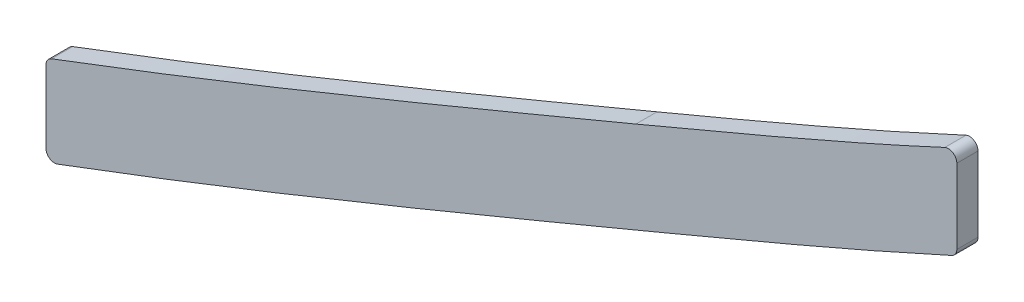
ISO-10303-21;
HEADER;
FILE_DESCRIPTION(('STEP AP214'),'2;1');
FILE_NAME('part.step','',(''),(''),'','','');
FILE_SCHEMA(('AUTOMOTIVE_DESIGN { 1 0 10303 214 1 1 1 1 }'));
ENDSEC;
DATA;
#1=APPLICATION_CONTEXT('core data for automotive mechanical design processes');
#2=APPLICATION_PROTOCOL_DEFINITION('international standard','automotive_design',2000,#1);
#3=PRODUCT_CONTEXT('',#1,'mechanical');
#4=PRODUCT('Part','Part','',(#3));
#5=PRODUCT_RELATED_PRODUCT_CATEGORY('part','',(#4));
#6=PRODUCT_DEFINITION_FORMATION('','',#4);
#7=PRODUCT_DEFINITION_CONTEXT('part definition',#1,'design');
#8=PRODUCT_DEFINITION('design','',#6,#7);
#9=PRODUCT_DEFINITION_SHAPE('','',#8);
#10=(LENGTH_UNIT() NAMED_UNIT(*) SI_UNIT(.MILLI.,.METRE.));
#11=(NAMED_UNIT(*) PLANE_ANGLE_UNIT() SI_UNIT($,.RADIAN.));
#12=(NAMED_UNIT(*) SI_UNIT($,.STERADIAN.) SOLID_ANGLE_UNIT());
#13=UNCERTAINTY_MEASURE_WITH_UNIT(LENGTH_MEASURE(1.E-05),#10,'distance_accuracy_value','');
#14=(GEOMETRIC_REPRESENTATION_CONTEXT(3) GLOBAL_UNCERTAINTY_ASSIGNED_CONTEXT((#13)) GLOBAL_UNIT_ASSIGNED_CONTEXT((#10,
#11,#12)) REPRESENTATION_CONTEXT('',''));
#15=CARTESIAN_POINT('',(0.,0.,0.));
#16=DIRECTION('',(0.,0.,1.));
#17=DIRECTION('',(1.,0.,0.));
#18=AXIS2_PLACEMENT_3D('',#15,#16,#17);
#19=CARTESIAN_POINT('',(191.607801579572,152.412778164943,-1.5875));
#20=CARTESIAN_POINT('',(201.073409420005,156.36620357869,-1.5875));
#21=CARTESIAN_POINT('',(210.56673521577,160.366210113804,-1.5875));
#22=CARTESIAN_POINT('',(220.096436884332,164.442364028046,-1.5875));
#23=CARTESIAN_POINT('',(229.661309685847,168.660462927977,-1.5875));
#24=CARTESIAN_POINT('',(239.230812588027,173.146496258096,-1.5875));
#25=(BOUNDED_CURVE() B_SPLINE_CURVE(5,(#19,#20,#21,#22,#23,#24),.UNSPECIFIED.,.F.,
.F.) B_SPLINE_CURVE_WITH_KNOTS((6,6),(14.8178103643843,19.6836854575926),
.UNSPECIFIED.) CURVE() GEOMETRIC_REPRESENTATION_ITEM() RATIONAL_B_SPLINE_CURVE((1.,1.,1.,1.,1.,1.)) REPRESENTATION_ITEM(''));
#26=DIRECTION('',(0.,0.,1.));
#27=VECTOR('',#26,1.);
#28=SURFACE_OF_LINEAR_EXTRUSION('',#25,#27);
#29=CARTESIAN_POINT('',(191.607801579572,152.412778164943,1.5875));
#30=CARTESIAN_POINT('',(200.811370336155,156.256759791144,1.5875));
#31=CARTESIAN_POINT('',(210.04114364221,160.144779200243,1.5875));
#32=CARTESIAN_POINT('',(219.305080098179,164.104014525206,1.5875));
#33=CARTESIAN_POINT('',(228.60232325091,168.194026782366,1.5875));
#34=CARTESIAN_POINT('',(237.906278264735,172.527582446985,1.5875));
#35=(BOUNDED_CURVE() B_SPLINE_CURVE(5,(#29,#30,#31,#32,#33,#34),.UNSPECIFIED.,.F.,
.F.) B_SPLINE_CURVE_WITH_KNOTS((6,6),(14.8178103643843,19.5489820689624),
.UNSPECIFIED.) CURVE() GEOMETRIC_REPRESENTATION_ITEM() RATIONAL_B_SPLINE_CURVE((1.,1.,1.,1.,1.,1.)) REPRESENTATION_ITEM(''));
#36=CARTESIAN_POINT('',(191.607801579572,152.412778164943,1.5875));
#37=VERTEX_POINT('',#36);
#38=CARTESIAN_POINT('',(237.906188472619,172.527775503803,1.5875));
#39=VERTEX_POINT('',#38);
#40=EDGE_CURVE('E228',#37,#39,#35,.T.);
#41=ORIENTED_EDGE('',*,*,#40,.T.);
#42=DIRECTION('',(0.,0.,1.));
#43=VECTOR('',#42,1.);
#44=CARTESIAN_POINT('',(237.906277943178,172.527582297211,1.5875));
#45=LINE('',#44,#43);
#46=CARTESIAN_POINT('',(237.906188323409,172.52777543439,-1.5875));
#47=VERTEX_POINT('',#46);
#48=EDGE_CURVE('E139',#39,#47,#45,.F.);
#49=ORIENTED_EDGE('',*,*,#48,.T.);
#50=CARTESIAN_POINT('',(237.9062782216,172.527582426893,-1.5875));
#51=CARTESIAN_POINT('',(228.602323216427,168.194026767197,-1.5875));
#52=CARTESIAN_POINT('',(219.305080072409,164.104014514193,-1.5875));
#53=CARTESIAN_POINT('',(210.041143625094,160.144779193032,-1.5875));
#54=CARTESIAN_POINT('',(200.811370327621,156.25675978758,-1.5875));
#55=CARTESIAN_POINT('',(191.607801579572,152.412778164943,-1.5875));
#56=(BOUNDED_CURVE() B_SPLINE_CURVE(5,(#50,#51,#52,#53,#54,#55),.UNSPECIFIED.,.F.,
.F.) B_SPLINE_CURVE_WITH_KNOTS((6,6),(14.8178103643843,19.5489820645755),
.UNSPECIFIED.) CURVE() GEOMETRIC_REPRESENTATION_ITEM() RATIONAL_B_SPLINE_CURVE((1.,1.,1.,1.,1.,1.)) REPRESENTATION_ITEM(''));
#57=CARTESIAN_POINT('',(191.607801579572,152.412778164943,-1.5875));
#58=VERTEX_POINT('',#57);
#59=EDGE_CURVE('E119',#58,#47,#56,.F.);
#60=ORIENTED_EDGE('',*,*,#59,.F.);
#61=DIRECTION('',(0.,0.,1.));
#62=VECTOR('',#61,1.);
#63=CARTESIAN_POINT('',(191.607801579572,152.412778164943,-1.5875));
#64=LINE('',#63,#62);
#65=EDGE_CURVE('E127',#58,#37,#64,.T.);
#66=ORIENTED_EDGE('',*,*,#65,.T.);
#67=EDGE_LOOP('',(#41,#49,#60,#66));
#68=FACE_BOUND('',#67,.T.);
#69=ADVANCED_FACE('F38',(#68),#28,.F.);
#70=CARTESIAN_POINT('',(239.7125,0.,-1.5875));
#71=DIRECTION('',(-1.,0.,0.));
#72=DIRECTION('',(0.,-1.,0.));
#73=AXIS2_PLACEMENT_3D('',#70,#71,#72);
#74=PLANE('',#73);
#75=DIRECTION('',(0.,-1.,0.));
#76=VECTOR('',#75,1.);
#77=CARTESIAN_POINT('',(239.7125,0.,1.5875));
#78=LINE('',#77,#76);
#79=CARTESIAN_POINT('',(239.7125,171.376336925547,1.5875));
#80=VERTEX_POINT('',#79);
#81=CARTESIAN_POINT('',(239.7125,160.187467402059,1.5875));
#82=VERTEX_POINT('',#81);
#83=EDGE_CURVE('E140',#80,#82,#78,.T.);
#84=ORIENTED_EDGE('',*,*,#83,.T.);
#85=DIRECTION('',(0.,0.,-1.));
#86=VECTOR('',#85,1.);
#87=CARTESIAN_POINT('',(239.7125,160.187467402059,-1.5875));
#88=LINE('',#87,#86);
#89=CARTESIAN_POINT('',(239.7125,160.187467402059,-1.5875));
#90=VERTEX_POINT('',#89);
#91=EDGE_CURVE('E183',#82,#90,#88,.T.);
#92=ORIENTED_EDGE('',*,*,#91,.T.);
#93=DIRECTION('',(0.,-1.,0.));
#94=VECTOR('',#93,1.);
#95=CARTESIAN_POINT('',(239.7125,0.,-1.5875));
#96=LINE('',#95,#94);
#97=CARTESIAN_POINT('',(239.7125,171.376336925547,-1.5875));
#98=VERTEX_POINT('',#97);
#99=EDGE_CURVE('E135',#98,#90,#96,.T.);
#100=ORIENTED_EDGE('',*,*,#99,.F.);
#101=DIRECTION('',(0.,0.,1.));
#102=VECTOR('',#101,1.);
#103=CARTESIAN_POINT('',(239.7125,171.376336925547,-1.5875));
#104=LINE('',#103,#102);
#105=EDGE_CURVE('E265',#98,#80,#104,.T.);
#106=ORIENTED_EDGE('',*,*,#105,.T.);
#107=EDGE_LOOP('',(#84,#92,#100,#106));
#108=FACE_BOUND('',#107,.T.);
#109=ADVANCED_FACE('F160',(#108),#74,.F.);
#110=CARTESIAN_POINT('',(196.502354722665,140.693846919755,-1.5875));
#111=CARTESIAN_POINT('',(200.47225867868,142.351925244404,-1.5875));
#112=CARTESIAN_POINT('',(208.383523135556,145.670232090297,-1.5875));
#113=CARTESIAN_POINT('',(220.364202496085,150.772038823093,-1.5875));
#114=CARTESIAN_POINT('',(230.422608343531,155.167131189749,-1.5875));
#115=CARTESIAN_POINT('',(238.51386846839,158.812385226018,-1.5875));
#116=CARTESIAN_POINT('',(242.593465626653,160.696633780215,-1.5875));
#117=CARTESIAN_POINT('',(244.621446784737,161.647319637257,-1.5875));
#118=B_SPLINE_CURVE_WITH_KNOTS('',3,(#110,#111,#112,#113,#114,#115,#116,#117),.UNSPECIFIED.,.F.,
.F.,(4,1,1,1,1,4),(14.8178103643843,16.0342791376864,17.2507479109885,18.4672166842906,
19.0754510709416,19.6836854575926),.UNSPECIFIED.);
#119=DIRECTION('',(0.,0.,1.));
#120=VECTOR('',#119,1.);
#121=SURFACE_OF_LINEAR_EXTRUSION('',#118,#120);
#122=CARTESIAN_POINT('',(196.502354722665,140.693846919755,-1.5875));
#123=VERTEX_POINT('',#122);
#124=CARTESIAN_POINT('',(238.970434409078,159.032398027644,-1.5875));
#125=VERTEX_POINT('',#124);
#126=EDGE_CURVE('E211',#123,#125,#118,.T.);
#127=ORIENTED_EDGE('',*,*,#126,.T.);
#128=DIRECTION('',(0.,0.,1.));
#129=VECTOR('',#128,1.);
#130=CARTESIAN_POINT('',(238.970434409078,159.032398027644,-1.5875));
#131=LINE('',#130,#129);
#132=CARTESIAN_POINT('',(238.970434409078,159.032398027644,1.5875));
#133=VERTEX_POINT('',#132);
#134=EDGE_CURVE('E246',#125,#133,#131,.T.);
#135=ORIENTED_EDGE('',*,*,#134,.T.);
#136=CARTESIAN_POINT('',(196.502354722665,140.693846919755,1.5875));
#137=CARTESIAN_POINT('',(200.47225867868,142.351925244404,1.5875));
#138=CARTESIAN_POINT('',(208.383523135556,145.670232090297,1.5875));
#139=CARTESIAN_POINT('',(220.364202496085,150.772038823093,1.5875));
#140=CARTESIAN_POINT('',(230.422608343531,155.167131189749,1.5875));
#141=CARTESIAN_POINT('',(238.51386846839,158.812385226018,1.5875));
#142=CARTESIAN_POINT('',(242.593465626653,160.696633780215,1.5875));
#143=CARTESIAN_POINT('',(244.621446784737,161.647319637257,1.5875));
#144=B_SPLINE_CURVE_WITH_KNOTS('',3,(#136,#137,#138,#139,#140,#141,#142,#143),.UNSPECIFIED.,.F.,
.F.,(4,1,1,1,1,4),(14.8178103643843,16.0342791376864,17.2507479109885,18.4672166842906,
19.0754510709416,19.6836854575926),.UNSPECIFIED.);
#145=CARTESIAN_POINT('',(196.502354722665,140.693846919755,1.5875));
#146=VERTEX_POINT('',#145);
#147=EDGE_CURVE('E226',#146,#133,#144,.T.);
#148=ORIENTED_EDGE('',*,*,#147,.F.);
#149=DIRECTION('',(0.,0.,1.));
#150=VECTOR('',#149,1.);
#151=CARTESIAN_POINT('',(196.502354722665,140.693846919755,-1.5875));
#152=LINE('',#151,#150);
#153=EDGE_CURVE('E134',#123,#146,#152,.T.);
#154=ORIENTED_EDGE('',*,*,#153,.F.);
#155=EDGE_LOOP('',(#127,#135,#148,#154));
#156=FACE_BOUND('',#155,.T.);
#157=ADVANCED_FACE('F274',(#156),#121,.T.);
#158=CARTESIAN_POINT('',(94.8455296397509,100.165835977271,-1.5875));
#159=CARTESIAN_POINT('',(99.2851792549158,101.772509666818,-1.5875));
#160=CARTESIAN_POINT('',(108.126245352757,105.036774500668,-1.5875));
#161=CARTESIAN_POINT('',(121.438654786891,110.116470414469,-1.5875));
#162=CARTESIAN_POINT('',(134.654525060538,115.297088101147,-1.5875));
#163=CARTESIAN_POINT('',(147.709166263227,120.526352792435,-1.5875));
#164=CARTESIAN_POINT('',(160.514652982033,125.743699314063,-1.5875));
#165=CARTESIAN_POINT('',(170.909613490182,130.032834423642,-1.5875));
#166=CARTESIAN_POINT('',(179.016898275823,133.399089085267,-1.5875));
#167=CARTESIAN_POINT('',(184.983371130968,135.884243484696,-1.5875));
#168=CARTESIAN_POINT('',(189.848103229836,137.914627662949,-1.5875));
#169=CARTESIAN_POINT('',(193.677721797771,139.514035727445,-1.5875));
#170=CARTESIAN_POINT('',(195.557921278026,140.299392887371,-1.5875));
#171=CARTESIAN_POINT('',(196.502354722665,140.693846919755,-1.5875));
#172=B_SPLINE_CURVE_WITH_KNOTS('',3,(#158,#159,#160,#161,#162,#163,#164,#165,#166,#167,#168,
#169,#170,#171),.UNSPECIFIED.,.F.,.F.,(4,1,1,1,1,1,1,1,1,1,1,4),(0.,0.125,0.25,0.375,0.5,0.625,
0.75,0.8125,0.875,0.9375,0.96875,1.),.UNSPECIFIED.);
#173=DIRECTION('',(0.,0.,1.));
#174=VECTOR('',#173,1.);
#175=SURFACE_OF_LINEAR_EXTRUSION('',#172,#174);
#176=CARTESIAN_POINT('',(94.8455296397509,100.165835977271,1.5875));
#177=CARTESIAN_POINT('',(99.2851792549158,101.772509666818,1.5875));
#178=CARTESIAN_POINT('',(108.126245352757,105.036774500668,1.5875));
#179=CARTESIAN_POINT('',(121.438654786891,110.116470414469,1.5875));
#180=CARTESIAN_POINT('',(134.654525060538,115.297088101147,1.5875));
#181=CARTESIAN_POINT('',(147.709166263227,120.526352792435,1.5875));
#182=CARTESIAN_POINT('',(160.514652982033,125.743699314063,1.5875));
#183=CARTESIAN_POINT('',(170.909613490182,130.032834423642,1.5875));
#184=CARTESIAN_POINT('',(179.016898275823,133.399089085267,1.5875));
#185=CARTESIAN_POINT('',(184.983371130968,135.884243484696,1.5875));
#186=CARTESIAN_POINT('',(189.848103229836,137.914627662949,1.5875));
#187=CARTESIAN_POINT('',(193.677721797771,139.514035727445,1.5875));
#188=CARTESIAN_POINT('',(195.557921278026,140.299392887371,1.5875));
#189=CARTESIAN_POINT('',(196.502354722665,140.693846919755,1.5875));
#190=B_SPLINE_CURVE_WITH_KNOTS('',3,(#176,#177,#178,#179,#180,#181,#182,#183,#184,#185,#186,
#187,#188,#189),.UNSPECIFIED.,.F.,.F.,(4,1,1,1,1,1,1,1,1,1,1,4),(0.,0.125,0.25,0.375,0.5,0.625,
0.75,0.8125,0.875,0.9375,0.96875,1.),.UNSPECIFIED.);
#191=CARTESIAN_POINT('',(104.900635681657,103.858169778956,1.5875));
#192=VERTEX_POINT('',#191);
#193=EDGE_CURVE('E207',#192,#146,#190,.T.);
#194=ORIENTED_EDGE('',*,*,#193,.F.);
#195=DIRECTION('',(0.,0.,1.));
#196=VECTOR('',#195,1.);
#197=CARTESIAN_POINT('',(104.900635681657,103.858169778956,1.5875));
#198=LINE('',#197,#196);
#199=CARTESIAN_POINT('',(104.900635681657,103.858169778956,-1.5875));
#200=VERTEX_POINT('',#199);
#201=EDGE_CURVE('E46',#192,#200,#198,.F.);
#202=ORIENTED_EDGE('',*,*,#201,.T.);
#203=EDGE_CURVE('E205',#200,#123,#172,.T.);
#204=ORIENTED_EDGE('',*,*,#203,.T.);
#205=ORIENTED_EDGE('',*,*,#153,.T.);
#206=EDGE_LOOP('',(#194,#202,#204,#205));
#207=FACE_BOUND('',#206,.T.);
#208=ADVANCED_FACE('F203',(#207),#175,.T.);
#209=CARTESIAN_POINT('',(103.187499999999,-4.00584788285194E-12,-1.5875));
#210=DIRECTION('',(-1.,0.,0.));
#211=DIRECTION('',(0.,-1.,0.));
#212=AXIS2_PLACEMENT_3D('',#209,#210,#211);
#213=PLANE('',#212);
#214=DIRECTION('',(0.,-1.,0.));
#215=VECTOR('',#214,1.);
#216=CARTESIAN_POINT('',(103.187499999999,-4.00584788285194E-12,-1.5875));
#217=LINE('',#216,#215);
#218=CARTESIAN_POINT('',(103.187500000004,115.895801382616,-1.5875));
#219=VERTEX_POINT('',#218);
#220=CARTESIAN_POINT('',(103.187500000004,105.048350760003,-1.5875));
#221=VERTEX_POINT('',#220);
#222=EDGE_CURVE('E124',#219,#221,#217,.T.);
#223=ORIENTED_EDGE('',*,*,#222,.T.);
#224=DIRECTION('',(0.,0.,1.));
#225=VECTOR('',#224,1.);
#226=CARTESIAN_POINT('',(103.187500000004,105.048350760003,-1.5875));
#227=LINE('',#226,#225);
#228=CARTESIAN_POINT('',(103.187500000004,105.048350760003,1.5875));
#229=VERTEX_POINT('',#228);
#230=EDGE_CURVE('E198',#221,#229,#227,.T.);
#231=ORIENTED_EDGE('',*,*,#230,.T.);
#232=DIRECTION('',(0.,-1.,0.));
#233=VECTOR('',#232,1.);
#234=CARTESIAN_POINT('',(103.187499999999,-4.00584788285194E-12,1.5875));
#235=LINE('',#234,#233);
#236=CARTESIAN_POINT('',(103.187500000004,115.895801382616,1.5875));
#237=VERTEX_POINT('',#236);
#238=EDGE_CURVE('E219',#237,#229,#235,.T.);
#239=ORIENTED_EDGE('',*,*,#238,.F.);
#240=DIRECTION('',(0.,0.,-1.));
#241=VECTOR('',#240,1.);
#242=CARTESIAN_POINT('',(103.187500000004,115.895801382616,-1.5875));
#243=LINE('',#242,#241);
#244=EDGE_CURVE('E194',#237,#219,#243,.T.);
#245=ORIENTED_EDGE('',*,*,#244,.T.);
#246=EDGE_LOOP('',(#223,#231,#239,#245));
#247=FACE_BOUND('',#246,.T.);
#248=ADVANCED_FACE('F218',(#247),#213,.T.);
#249=CARTESIAN_POINT('',(90.5237963008118,112.107888604315,-1.5875));
#250=CARTESIAN_POINT('',(125.479231155433,124.757980921461,-1.5875));
#251=CARTESIAN_POINT('',(161.572202824917,139.868047658936,-1.5875));
#252=CARTESIAN_POINT('',(191.607801579572,152.412778164943,-1.5875));
#253=B_SPLINE_CURVE_WITH_KNOTS('',3,(#249,#250,#251,#252),.UNSPECIFIED.,.F.,.F.,(4,4),(0.,1.),.UNSPECIFIED.);
#254=DIRECTION('',(0.,0.,1.));
#255=VECTOR('',#254,1.);
#256=SURFACE_OF_LINEAR_EXTRUSION('',#253,#255);
#257=CARTESIAN_POINT('',(104.010831759366,117.08466112321,-1.5875));
#258=VERTEX_POINT('',#257);
#259=EDGE_CURVE('E114',#258,#58,#253,.T.);
#260=ORIENTED_EDGE('',*,*,#259,.F.);
#261=DIRECTION('',(0.,0.,1.));
#262=VECTOR('',#261,1.);
#263=CARTESIAN_POINT('',(104.010831759366,117.08466112321,-1.5875));
#264=LINE('',#263,#262);
#265=CARTESIAN_POINT('',(104.010831759367,117.084661123211,1.5875));
#266=VERTEX_POINT('',#265);
#267=EDGE_CURVE('E11',#258,#266,#264,.T.);
#268=ORIENTED_EDGE('',*,*,#267,.T.);
#269=CARTESIAN_POINT('',(90.5237963008118,112.107888604315,1.5875));
#270=CARTESIAN_POINT('',(125.479231155433,124.757980921461,1.5875));
#271=CARTESIAN_POINT('',(161.572202824917,139.868047658936,1.5875));
#272=CARTESIAN_POINT('',(191.607801579572,152.412778164943,1.5875));
#273=B_SPLINE_CURVE_WITH_KNOTS('',3,(#269,#270,#271,#272),.UNSPECIFIED.,.F.,.F.,(4,4),(0.,1.),.UNSPECIFIED.);
#274=EDGE_CURVE('E130',#266,#37,#273,.T.);
#275=ORIENTED_EDGE('',*,*,#274,.T.);
#276=ORIENTED_EDGE('',*,*,#65,.F.);
#277=EDGE_LOOP('',(#260,#268,#275,#276));
#278=FACE_BOUND('',#277,.T.);
#279=ADVANCED_FACE('F128',(#278),#256,.F.);
#280=CARTESIAN_POINT('',(0.,0.,-1.5875));
#281=DIRECTION('',(0.,0.,1.));
#282=DIRECTION('',(1.,0.,0.));
#283=AXIS2_PLACEMENT_3D('',#280,#281,#282);
#284=PLANE('',#283);
#285=ORIENTED_EDGE('',*,*,#99,.T.);
#286=CARTESIAN_POINT('',(238.4425,160.187467402059,-1.5875));
#287=DIRECTION('',(0.,0.,1.));
#288=DIRECTION('',(1.,0.,0.));
#289=AXIS2_PLACEMENT_3D('',#286,#287,#288);
#290=CIRCLE('',#289,1.27);
#291=EDGE_CURVE('E189',#90,#125,#290,.F.);
#292=ORIENTED_EDGE('',*,*,#291,.T.);
#293=ORIENTED_EDGE('',*,*,#126,.F.);
#294=ORIENTED_EDGE('',*,*,#203,.F.);
#295=CARTESIAN_POINT('',(104.457500000004,105.048350760003,-1.5875));
#296=DIRECTION('',(0.,0.,1.));
#297=DIRECTION('',(1.,0.,0.));
#298=AXIS2_PLACEMENT_3D('',#295,#296,#297);
#299=CIRCLE('',#298,1.27);
#300=EDGE_CURVE('E59',#200,#221,#299,.F.);
#301=ORIENTED_EDGE('',*,*,#300,.T.);
#302=ORIENTED_EDGE('',*,*,#222,.F.);
#303=CARTESIAN_POINT('',(104.457500000004,115.895801382616,-1.5875));
#304=DIRECTION('',(0.,0.,1.));
#305=DIRECTION('',(1.,0.,0.));
#306=AXIS2_PLACEMENT_3D('',#303,#304,#305);
#307=CIRCLE('',#306,1.27);
#308=EDGE_CURVE('E53',#219,#258,#307,.F.);
#309=ORIENTED_EDGE('',*,*,#308,.T.);
#310=ORIENTED_EDGE('',*,*,#259,.T.);
#311=ORIENTED_EDGE('',*,*,#59,.T.);
#312=CARTESIAN_POINT('',(238.4425,171.376336925547,-1.5875));
#313=DIRECTION('',(0.,0.,1.));
#314=DIRECTION('',(1.,0.,0.));
#315=AXIS2_PLACEMENT_3D('',#312,#313,#314);
#316=CIRCLE('',#315,1.27);
#317=EDGE_CURVE('E187',#47,#98,#316,.F.);
#318=ORIENTED_EDGE('',*,*,#317,.T.);
#319=EDGE_LOOP('',(#285,#292,#293,#294,#301,#302,#309,#310,#311,#318));
#320=FACE_BOUND('',#319,.T.);
#321=ADVANCED_FACE('F117',(#320),#284,.F.);
#322=CARTESIAN_POINT('',(0.,0.,1.5875));
#323=DIRECTION('',(0.,0.,1.));
#324=DIRECTION('',(1.,0.,0.));
#325=AXIS2_PLACEMENT_3D('',#322,#323,#324);
#326=PLANE('',#325);
#327=ORIENTED_EDGE('',*,*,#147,.T.);
#328=CARTESIAN_POINT('',(238.4425,160.187467402059,1.5875));
#329=DIRECTION('',(0.,0.,1.));
#330=DIRECTION('',(1.,0.,0.));
#331=AXIS2_PLACEMENT_3D('',#328,#329,#330);
#332=CIRCLE('',#331,1.27);
#333=EDGE_CURVE('E262',#133,#82,#332,.T.);
#334=ORIENTED_EDGE('',*,*,#333,.T.);
#335=ORIENTED_EDGE('',*,*,#83,.F.);
#336=CARTESIAN_POINT('',(238.4425,171.376336925547,1.5875));
#337=DIRECTION('',(0.,0.,1.));
#338=DIRECTION('',(1.,0.,0.));
#339=AXIS2_PLACEMENT_3D('',#336,#337,#338);
#340=CIRCLE('',#339,1.27);
#341=EDGE_CURVE('E260',#80,#39,#340,.T.);
#342=ORIENTED_EDGE('',*,*,#341,.T.);
#343=ORIENTED_EDGE('',*,*,#40,.F.);
#344=ORIENTED_EDGE('',*,*,#274,.F.);
#345=CARTESIAN_POINT('',(104.457500000004,115.895801382616,1.5875));
#346=DIRECTION('',(0.,0.,1.));
#347=DIRECTION('',(1.,0.,0.));
#348=AXIS2_PLACEMENT_3D('',#345,#346,#347);
#349=CIRCLE('',#348,1.27);
#350=EDGE_CURVE('E224',#266,#237,#349,.T.);
#351=ORIENTED_EDGE('',*,*,#350,.T.);
#352=ORIENTED_EDGE('',*,*,#238,.T.);
#353=CARTESIAN_POINT('',(104.457500000004,105.048350760003,1.5875));
#354=DIRECTION('',(0.,0.,1.));
#355=DIRECTION('',(1.,0.,0.));
#356=AXIS2_PLACEMENT_3D('',#353,#354,#355);
#357=CIRCLE('',#356,1.27);
#358=EDGE_CURVE('E214',#229,#192,#357,.T.);
#359=ORIENTED_EDGE('',*,*,#358,.T.);
#360=ORIENTED_EDGE('',*,*,#193,.T.);
#361=EDGE_LOOP('',(#327,#334,#335,#342,#343,#344,#351,#352,#359,#360));
#362=FACE_BOUND('',#361,.T.);
#363=ADVANCED_FACE('F223',(#362),#326,.T.);
#364=CARTESIAN_POINT('',(238.4425,160.187467402059,0.));
#365=DIRECTION('',(0.,0.,1.));
#366=DIRECTION('',(1.,0.,0.));
#367=AXIS2_PLACEMENT_3D('',#364,#365,#366);
#368=CYLINDRICAL_SURFACE('',#367,1.27);
#369=ORIENTED_EDGE('',*,*,#291,.F.);
#370=ORIENTED_EDGE('',*,*,#91,.F.);
#371=ORIENTED_EDGE('',*,*,#333,.F.);
#372=ORIENTED_EDGE('',*,*,#134,.F.);
#373=EDGE_LOOP('',(#369,#370,#371,#372));
#374=FACE_BOUND('',#373,.T.);
#375=ADVANCED_FACE('F163',(#374),#368,.T.);
#376=CARTESIAN_POINT('',(238.4425,171.376336925547,0.));
#377=DIRECTION('',(0.,0.,1.));
#378=DIRECTION('',(1.,0.,0.));
#379=AXIS2_PLACEMENT_3D('',#376,#377,#378);
#380=CYLINDRICAL_SURFACE('',#379,1.27);
#381=ORIENTED_EDGE('',*,*,#317,.F.);
#382=ORIENTED_EDGE('',*,*,#48,.F.);
#383=ORIENTED_EDGE('',*,*,#341,.F.);
#384=ORIENTED_EDGE('',*,*,#105,.F.);
#385=EDGE_LOOP('',(#381,#382,#383,#384));
#386=FACE_BOUND('',#385,.T.);
#387=ADVANCED_FACE('F321',(#386),#380,.T.);
#388=CARTESIAN_POINT('',(104.457500000004,105.048350760003,0.));
#389=DIRECTION('',(0.,0.,1.));
#390=DIRECTION('',(1.,0.,0.));
#391=AXIS2_PLACEMENT_3D('',#388,#389,#390);
#392=CYLINDRICAL_SURFACE('',#391,1.27);
#393=ORIENTED_EDGE('',*,*,#300,.F.);
#394=ORIENTED_EDGE('',*,*,#201,.F.);
#395=ORIENTED_EDGE('',*,*,#358,.F.);
#396=ORIENTED_EDGE('',*,*,#230,.F.);
#397=EDGE_LOOP('',(#393,#394,#395,#396));
#398=FACE_BOUND('',#397,.T.);
#399=ADVANCED_FACE('F213',(#398),#392,.T.);
#400=CARTESIAN_POINT('',(104.457500000004,115.895801382616,0.));
#401=DIRECTION('',(0.,0.,1.));
#402=DIRECTION('',(1.,0.,0.));
#403=AXIS2_PLACEMENT_3D('',#400,#401,#402);
#404=CYLINDRICAL_SURFACE('',#403,1.27);
#405=ORIENTED_EDGE('',*,*,#308,.F.);
#406=ORIENTED_EDGE('',*,*,#244,.F.);
#407=ORIENTED_EDGE('',*,*,#350,.F.);
#408=ORIENTED_EDGE('',*,*,#267,.F.);
#409=EDGE_LOOP('',(#405,#406,#407,#408));
#410=FACE_BOUND('',#409,.T.);
#411=ADVANCED_FACE('F40',(#410),#404,.T.);
#412=CLOSED_SHELL('',(#69,#109,#157,#208,#248,#279,#321,#363,#375,#387,#399,#411));
#413=MANIFOLD_SOLID_BREP('B2',#412);
#414=ADVANCED_BREP_SHAPE_REPRESENTATION('',(#18,#413),#14);
#415=SHAPE_DEFINITION_REPRESENTATION(#9,#414);
ENDSEC;
END-ISO-10303-21;
